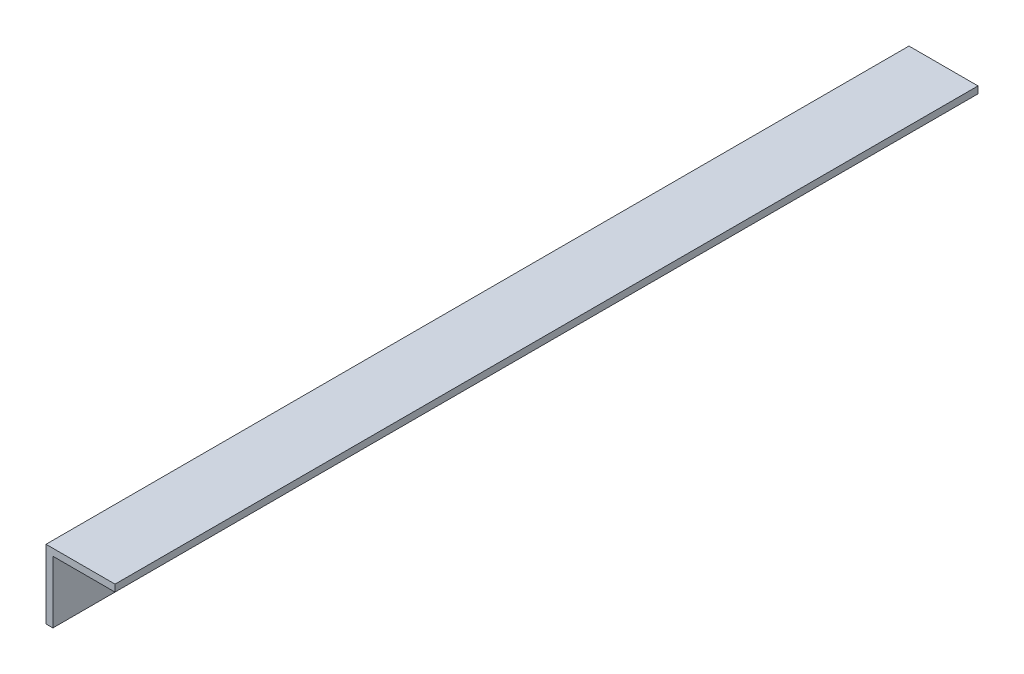
ISO-10303-21;
HEADER;
FILE_DESCRIPTION(('STEP AP214'),'2;1');
FILE_NAME('part.step','',(''),(''),'','','');
FILE_SCHEMA(('AUTOMOTIVE_DESIGN { 1 0 10303 214 1 1 1 1 }'));
ENDSEC;
DATA;
#1=APPLICATION_CONTEXT('core data for automotive mechanical design processes');
#2=APPLICATION_PROTOCOL_DEFINITION('international standard','automotive_design',2000,#1);
#3=PRODUCT_CONTEXT('',#1,'mechanical');
#4=PRODUCT('Part','Part','',(#3));
#5=PRODUCT_RELATED_PRODUCT_CATEGORY('part','',(#4));
#6=PRODUCT_DEFINITION_FORMATION('','',#4);
#7=PRODUCT_DEFINITION_CONTEXT('part definition',#1,'design');
#8=PRODUCT_DEFINITION('design','',#6,#7);
#9=PRODUCT_DEFINITION_SHAPE('','',#8);
#10=(LENGTH_UNIT() NAMED_UNIT(*) SI_UNIT(.MILLI.,.METRE.));
#11=(NAMED_UNIT(*) PLANE_ANGLE_UNIT() SI_UNIT($,.RADIAN.));
#12=(NAMED_UNIT(*) SI_UNIT($,.STERADIAN.) SOLID_ANGLE_UNIT());
#13=UNCERTAINTY_MEASURE_WITH_UNIT(LENGTH_MEASURE(1.E-05),#10,'distance_accuracy_value','');
#14=(GEOMETRIC_REPRESENTATION_CONTEXT(3) GLOBAL_UNCERTAINTY_ASSIGNED_CONTEXT((#13)) GLOBAL_UNIT_ASSIGNED_CONTEXT((#10,
#11,#12)) REPRESENTATION_CONTEXT('',''));
#15=CARTESIAN_POINT('',(0.,0.,0.));
#16=DIRECTION('',(0.,0.,1.));
#17=DIRECTION('',(1.,0.,0.));
#18=AXIS2_PLACEMENT_3D('',#15,#16,#17);
#19=CARTESIAN_POINT('',(4.,0.,500.));
#20=DIRECTION('',(0.,1.,0.));
#21=DIRECTION('',(-1.,0.,0.));
#22=AXIS2_PLACEMENT_3D('',#19,#20,#21);
#23=PLANE('',#22);
#24=DIRECTION('',(1.,0.,0.));
#25=VECTOR('',#24,1.);
#26=CARTESIAN_POINT('',(4.,0.,0.));
#27=LINE('',#26,#25);
#28=CARTESIAN_POINT('',(0.,0.,0.));
#29=VERTEX_POINT('',#28);
#30=CARTESIAN_POINT('',(4.,0.,0.));
#31=VERTEX_POINT('',#30);
#32=EDGE_CURVE('E118',#29,#31,#27,.T.);
#33=ORIENTED_EDGE('',*,*,#32,.T.);
#34=DIRECTION('',(0.,0.,-1.));
#35=VECTOR('',#34,1.);
#36=CARTESIAN_POINT('',(4.,0.,500.));
#37=LINE('',#36,#35);
#38=CARTESIAN_POINT('',(4.,0.,500.));
#39=VERTEX_POINT('',#38);
#40=EDGE_CURVE('E11',#39,#31,#37,.T.);
#41=ORIENTED_EDGE('',*,*,#40,.F.);
#42=DIRECTION('',(1.,0.,0.));
#43=VECTOR('',#42,1.);
#44=CARTESIAN_POINT('',(4.,0.,500.));
#45=LINE('',#44,#43);
#46=CARTESIAN_POINT('',(0.,0.,500.));
#47=VERTEX_POINT('',#46);
#48=EDGE_CURVE('E128',#47,#39,#45,.T.);
#49=ORIENTED_EDGE('',*,*,#48,.F.);
#50=DIRECTION('',(0.,0.,-1.));
#51=VECTOR('',#50,1.);
#52=CARTESIAN_POINT('',(0.,0.,500.));
#53=LINE('',#52,#51);
#54=EDGE_CURVE('E114',#47,#29,#53,.T.);
#55=ORIENTED_EDGE('',*,*,#54,.T.);
#56=EDGE_LOOP('',(#33,#41,#49,#55));
#57=FACE_BOUND('',#56,.T.);
#58=ADVANCED_FACE('F34',(#57),#23,.F.);
#59=CARTESIAN_POINT('',(3.99999999999999,36.,500.));
#60=DIRECTION('',(-1.,0.,0.));
#61=DIRECTION('',(0.,-1.,0.));
#62=AXIS2_PLACEMENT_3D('',#59,#60,#61);
#63=PLANE('',#62);
#64=DIRECTION('',(0.,1.,0.));
#65=VECTOR('',#64,1.);
#66=CARTESIAN_POINT('',(3.99999999999999,36.,0.));
#67=LINE('',#66,#65);
#68=CARTESIAN_POINT('',(3.99999999999999,36.,0.));
#69=VERTEX_POINT('',#68);
#70=EDGE_CURVE('E121',#31,#69,#67,.T.);
#71=ORIENTED_EDGE('',*,*,#70,.T.);
#72=DIRECTION('',(0.,0.,-1.));
#73=VECTOR('',#72,1.);
#74=CARTESIAN_POINT('',(3.99999999999999,36.,500.));
#75=LINE('',#74,#73);
#76=CARTESIAN_POINT('',(3.99999999999999,36.,500.));
#77=VERTEX_POINT('',#76);
#78=EDGE_CURVE('E42',#77,#69,#75,.T.);
#79=ORIENTED_EDGE('',*,*,#78,.F.);
#80=DIRECTION('',(0.,1.,0.));
#81=VECTOR('',#80,1.);
#82=CARTESIAN_POINT('',(3.99999999999999,36.,500.));
#83=LINE('',#82,#81);
#84=EDGE_CURVE('E87',#39,#77,#83,.T.);
#85=ORIENTED_EDGE('',*,*,#84,.F.);
#86=ORIENTED_EDGE('',*,*,#40,.T.);
#87=EDGE_LOOP('',(#71,#79,#85,#86));
#88=FACE_BOUND('',#87,.T.);
#89=ADVANCED_FACE('F152',(#88),#63,.F.);
#90=CARTESIAN_POINT('',(40.,36.,500.));
#91=DIRECTION('',(0.,1.,0.));
#92=DIRECTION('',(-1.,0.,0.));
#93=AXIS2_PLACEMENT_3D('',#90,#91,#92);
#94=PLANE('',#93);
#95=DIRECTION('',(1.,0.,0.));
#96=VECTOR('',#95,1.);
#97=CARTESIAN_POINT('',(40.,36.,0.));
#98=LINE('',#97,#96);
#99=CARTESIAN_POINT('',(40.,36.,0.));
#100=VERTEX_POINT('',#99);
#101=EDGE_CURVE('E123',#69,#100,#98,.T.);
#102=ORIENTED_EDGE('',*,*,#101,.T.);
#103=DIRECTION('',(0.,0.,-1.));
#104=VECTOR('',#103,1.);
#105=CARTESIAN_POINT('',(40.,36.,500.));
#106=LINE('',#105,#104);
#107=CARTESIAN_POINT('',(40.,36.,500.));
#108=VERTEX_POINT('',#107);
#109=EDGE_CURVE('E109',#108,#100,#106,.T.);
#110=ORIENTED_EDGE('',*,*,#109,.F.);
#111=DIRECTION('',(1.,0.,0.));
#112=VECTOR('',#111,1.);
#113=CARTESIAN_POINT('',(40.,36.,500.));
#114=LINE('',#113,#112);
#115=EDGE_CURVE('E100',#77,#108,#114,.T.);
#116=ORIENTED_EDGE('',*,*,#115,.F.);
#117=ORIENTED_EDGE('',*,*,#78,.T.);
#118=EDGE_LOOP('',(#102,#110,#116,#117));
#119=FACE_BOUND('',#118,.T.);
#120=ADVANCED_FACE('F134',(#119),#94,.F.);
#121=CARTESIAN_POINT('',(40.,40.,500.));
#122=DIRECTION('',(-1.,0.,0.));
#123=DIRECTION('',(0.,0.,1.));
#124=AXIS2_PLACEMENT_3D('',#121,#122,#123);
#125=PLANE('',#124);
#126=DIRECTION('',(0.,1.,0.));
#127=VECTOR('',#126,1.);
#128=CARTESIAN_POINT('',(40.,40.,0.));
#129=LINE('',#128,#127);
#130=CARTESIAN_POINT('',(40.,40.,0.));
#131=VERTEX_POINT('',#130);
#132=EDGE_CURVE('E108',#100,#131,#129,.T.);
#133=ORIENTED_EDGE('',*,*,#132,.T.);
#134=DIRECTION('',(0.,0.,-1.));
#135=VECTOR('',#134,1.);
#136=CARTESIAN_POINT('',(40.,40.,500.));
#137=LINE('',#136,#135);
#138=CARTESIAN_POINT('',(40.,40.,500.));
#139=VERTEX_POINT('',#138);
#140=EDGE_CURVE('E105',#139,#131,#137,.T.);
#141=ORIENTED_EDGE('',*,*,#140,.F.);
#142=DIRECTION('',(0.,1.,0.));
#143=VECTOR('',#142,1.);
#144=CARTESIAN_POINT('',(40.,40.,500.));
#145=LINE('',#144,#143);
#146=EDGE_CURVE('E94',#108,#139,#145,.T.);
#147=ORIENTED_EDGE('',*,*,#146,.F.);
#148=ORIENTED_EDGE('',*,*,#109,.T.);
#149=EDGE_LOOP('',(#133,#141,#147,#148));
#150=FACE_BOUND('',#149,.T.);
#151=ADVANCED_FACE('F106',(#150),#125,.F.);
#152=CARTESIAN_POINT('',(0.,40.,500.));
#153=DIRECTION('',(0.,-1.,0.));
#154=DIRECTION('',(0.,0.,-1.));
#155=AXIS2_PLACEMENT_3D('',#152,#153,#154);
#156=PLANE('',#155);
#157=DIRECTION('',(-1.,0.,0.));
#158=VECTOR('',#157,1.);
#159=CARTESIAN_POINT('',(0.,40.,0.));
#160=LINE('',#159,#158);
#161=CARTESIAN_POINT('',(0.,40.,0.));
#162=VERTEX_POINT('',#161);
#163=EDGE_CURVE('E73',#131,#162,#160,.T.);
#164=ORIENTED_EDGE('',*,*,#163,.T.);
#165=DIRECTION('',(0.,0.,-1.));
#166=VECTOR('',#165,1.);
#167=CARTESIAN_POINT('',(0.,40.,500.));
#168=LINE('',#167,#166);
#169=CARTESIAN_POINT('',(0.,40.,500.));
#170=VERTEX_POINT('',#169);
#171=EDGE_CURVE('E110',#170,#162,#168,.T.);
#172=ORIENTED_EDGE('',*,*,#171,.F.);
#173=DIRECTION('',(-1.,0.,0.));
#174=VECTOR('',#173,1.);
#175=CARTESIAN_POINT('',(0.,40.,500.));
#176=LINE('',#175,#174);
#177=EDGE_CURVE('E98',#139,#170,#176,.T.);
#178=ORIENTED_EDGE('',*,*,#177,.F.);
#179=ORIENTED_EDGE('',*,*,#140,.T.);
#180=EDGE_LOOP('',(#164,#172,#178,#179));
#181=FACE_BOUND('',#180,.T.);
#182=ADVANCED_FACE('F112',(#181),#156,.F.);
#183=CARTESIAN_POINT('',(0.,0.,500.));
#184=DIRECTION('',(1.,0.,0.));
#185=DIRECTION('',(0.,0.,-1.));
#186=AXIS2_PLACEMENT_3D('',#183,#184,#185);
#187=PLANE('',#186);
#188=DIRECTION('',(0.,-1.,0.));
#189=VECTOR('',#188,1.);
#190=CARTESIAN_POINT('',(0.,0.,0.));
#191=LINE('',#190,#189);
#192=EDGE_CURVE('E79',#162,#29,#191,.T.);
#193=ORIENTED_EDGE('',*,*,#192,.T.);
#194=ORIENTED_EDGE('',*,*,#54,.F.);
#195=DIRECTION('',(0.,-1.,0.));
#196=VECTOR('',#195,1.);
#197=CARTESIAN_POINT('',(0.,0.,500.));
#198=LINE('',#197,#196);
#199=EDGE_CURVE('E50',#170,#47,#198,.T.);
#200=ORIENTED_EDGE('',*,*,#199,.F.);
#201=ORIENTED_EDGE('',*,*,#171,.T.);
#202=EDGE_LOOP('',(#193,#194,#200,#201));
#203=FACE_BOUND('',#202,.T.);
#204=ADVANCED_FACE('F141',(#203),#187,.F.);
#205=CARTESIAN_POINT('',(0.,0.,500.));
#206=DIRECTION('',(0.,0.,-1.));
#207=DIRECTION('',(-1.,0.,0.));
#208=AXIS2_PLACEMENT_3D('',#205,#206,#207);
#209=PLANE('',#208);
#210=ORIENTED_EDGE('',*,*,#48,.T.);
#211=ORIENTED_EDGE('',*,*,#84,.T.);
#212=ORIENTED_EDGE('',*,*,#115,.T.);
#213=ORIENTED_EDGE('',*,*,#146,.T.);
#214=ORIENTED_EDGE('',*,*,#177,.T.);
#215=ORIENTED_EDGE('',*,*,#199,.T.);
#216=EDGE_LOOP('',(#210,#211,#212,#213,#214,#215));
#217=FACE_BOUND('',#216,.T.);
#218=ADVANCED_FACE('F96',(#217),#209,.F.);
#219=CARTESIAN_POINT('',(0.,0.,0.));
#220=DIRECTION('',(0.,0.,-1.));
#221=DIRECTION('',(-1.,0.,0.));
#222=AXIS2_PLACEMENT_3D('',#219,#220,#221);
#223=PLANE('',#222);
#224=ORIENTED_EDGE('',*,*,#32,.F.);
#225=ORIENTED_EDGE('',*,*,#192,.F.);
#226=ORIENTED_EDGE('',*,*,#163,.F.);
#227=ORIENTED_EDGE('',*,*,#132,.F.);
#228=ORIENTED_EDGE('',*,*,#101,.F.);
#229=ORIENTED_EDGE('',*,*,#70,.F.);
#230=EDGE_LOOP('',(#224,#225,#226,#227,#228,#229));
#231=FACE_BOUND('',#230,.T.);
#232=ADVANCED_FACE('F137',(#231),#223,.T.);
#233=CLOSED_SHELL('',(#58,#89,#120,#151,#182,#204,#218,#232));
#234=MANIFOLD_SOLID_BREP('B2',#233);
#235=ADVANCED_BREP_SHAPE_REPRESENTATION('',(#18,#234),#14);
#236=SHAPE_DEFINITION_REPRESENTATION(#9,#235);
ENDSEC;
END-ISO-10303-21;
